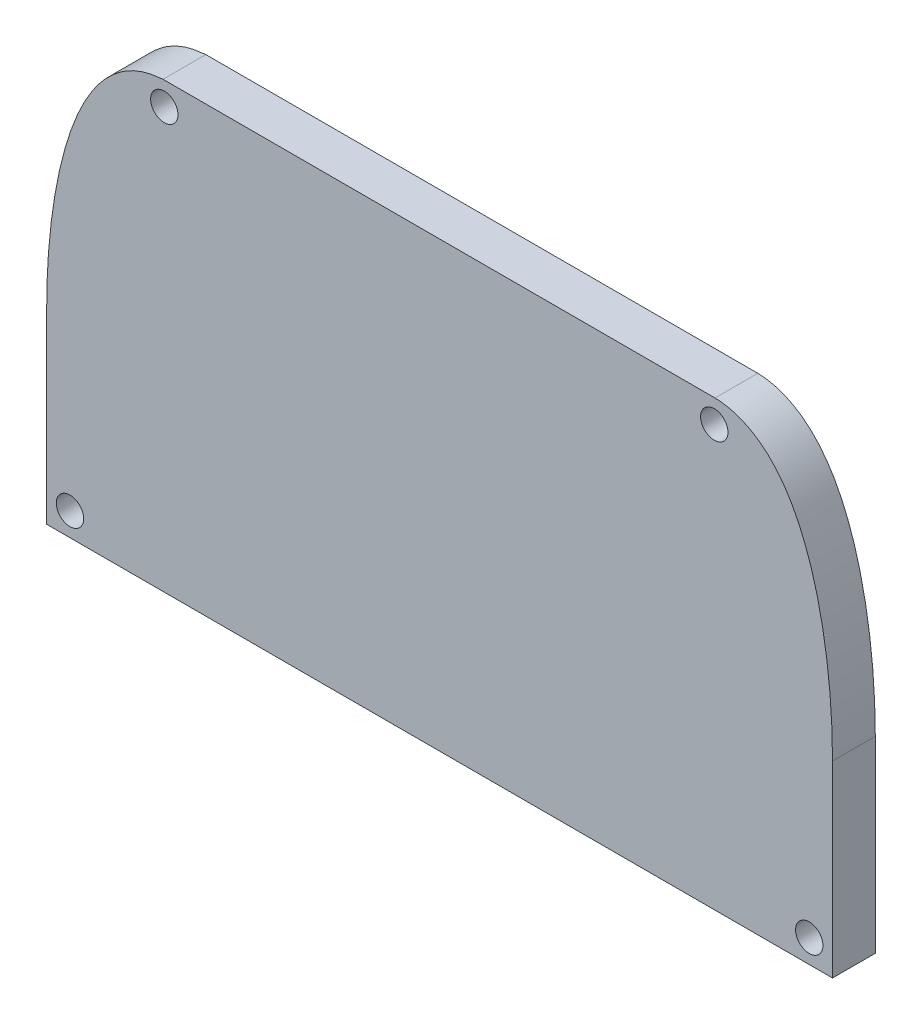
ISO-10303-21;
HEADER;
FILE_DESCRIPTION(('STEP AP214'),'2;1');
FILE_NAME('part.step','',(''),(''),'','','');
FILE_SCHEMA(('AUTOMOTIVE_DESIGN { 1 0 10303 214 1 1 1 1 }'));
ENDSEC;
DATA;
#1=APPLICATION_CONTEXT('core data for automotive mechanical design processes');
#2=APPLICATION_PROTOCOL_DEFINITION('international standard','automotive_design',2000,#1);
#3=PRODUCT_CONTEXT('',#1,'mechanical');
#4=PRODUCT('Part','Part','',(#3));
#5=PRODUCT_RELATED_PRODUCT_CATEGORY('part','',(#4));
#6=PRODUCT_DEFINITION_FORMATION('','',#4);
#7=PRODUCT_DEFINITION_CONTEXT('part definition',#1,'design');
#8=PRODUCT_DEFINITION('design','',#6,#7);
#9=PRODUCT_DEFINITION_SHAPE('','',#8);
#10=(LENGTH_UNIT() NAMED_UNIT(*) SI_UNIT(.MILLI.,.METRE.));
#11=(NAMED_UNIT(*) PLANE_ANGLE_UNIT() SI_UNIT($,.RADIAN.));
#12=(NAMED_UNIT(*) SI_UNIT($,.STERADIAN.) SOLID_ANGLE_UNIT());
#13=UNCERTAINTY_MEASURE_WITH_UNIT(LENGTH_MEASURE(1.E-05),#10,'distance_accuracy_value','');
#14=(GEOMETRIC_REPRESENTATION_CONTEXT(3) GLOBAL_UNCERTAINTY_ASSIGNED_CONTEXT((#13)) GLOBAL_UNIT_ASSIGNED_CONTEXT((#10,
#11,#12)) REPRESENTATION_CONTEXT('',''));
#15=CARTESIAN_POINT('',(0.,0.,0.));
#16=DIRECTION('',(0.,0.,1.));
#17=DIRECTION('',(1.,0.,0.));
#18=AXIS2_PLACEMENT_3D('',#15,#16,#17);
#19=CARTESIAN_POINT('',(-20.2031299012888,38.8775103117282,3.125));
#20=CARTESIAN_POINT('',(-20.6299370312421,38.8425432630061,3.125));
#21=CARTESIAN_POINT('',(-21.2365770901515,38.7293476692277,3.125));
#22=CARTESIAN_POINT('',(-21.7787783124559,38.5939845344441,3.125));
#23=CARTESIAN_POINT('',(-22.8102743204747,38.1543126758593,3.125));
#24=CARTESIAN_POINT('',(-23.7716144326433,37.4400939137029,3.125));
#25=CARTESIAN_POINT('',(-24.3768724896182,36.8494792872663,3.125));
#26=CARTESIAN_POINT('',(-24.8388727645608,36.3127991268402,3.125));
#27=CARTESIAN_POINT('',(-25.2341536045405,35.7760936133862,3.125));
#28=CARTESIAN_POINT('',(-25.6269844321493,35.1612285433474,3.125));
#29=CARTESIAN_POINT('',(-25.9472276573327,34.5877555784463,3.125));
#30=CARTESIAN_POINT('',(-26.2795466081274,33.9133394349288,3.125));
#31=CARTESIAN_POINT('',(-26.5359865020166,33.3294266872606,3.125));
#32=CARTESIAN_POINT('',(-26.7897757638346,32.689408081855,3.125));
#33=CARTESIAN_POINT('',(-27.0269246103089,32.0230810706468,3.125));
#34=CARTESIAN_POINT('',(-27.2573329434744,31.2983450904732,3.125));
#35=CARTESIAN_POINT('',(-27.4335637787405,30.6825001719424,3.125));
#36=CARTESIAN_POINT('',(-27.6069824014113,30.0157827044821,3.125));
#37=CARTESIAN_POINT('',(-27.7680984967872,29.3289301463425,3.125));
#38=CARTESIAN_POINT('',(-27.9221330026003,28.5974838959154,3.125));
#39=CARTESIAN_POINT('',(-28.0465595621333,27.9395798152964,3.125));
#40=CARTESIAN_POINT('',(-28.1922280839524,27.08168551276,3.125));
#41=CARTESIAN_POINT('',(-28.3674536756337,25.8348274061817,3.125));
#42=CARTESIAN_POINT('',(-28.5162514330903,24.4381764406579,3.125));
#43=CARTESIAN_POINT('',(-28.6106169145931,23.1928281129806,3.125));
#44=CARTESIAN_POINT('',(-28.6481655742006,22.4360444979002,3.125));
#45=CARTESIAN_POINT('',(-28.6631956686964,22.0319801847861,3.125));
#46=CARTESIAN_POINT('',(-28.670287972966,21.8062878665656,3.125));
#47=CARTESIAN_POINT('',(-28.6757196537256,21.6075614959583,3.125));
#48=CARTESIAN_POINT('',(-28.6783448183677,21.4974656488177,3.125));
#49=CARTESIAN_POINT('',(-28.6822331339818,21.3196666692372,3.125));
#50=CARTESIAN_POINT('',(-28.692153993551,20.7941564589934,3.125));
#51=CARTESIAN_POINT('',(-28.7000000000001,20.2019635455945,3.125));
#52=B_SPLINE_CURVE_WITH_KNOTS('',2,(#19,#20,#21,#22,#23,#24,#25,#26,#27,#28,#29,#30,#31,#32,#33,
#34,#35,#36,#37,#38,#39,#40,#41,#42,#43,#44,#45,#46,#47,#48,#49,#50,#51),.UNSPECIFIED.,.F.,.F.,
(3,1,1,1,1,1,1,1,1,1,1,1,1,1,1,1,1,1,1,1,1,1,1,1,1,1,1,1,1,1,1,3),(6.54310850195519E-05,
0.0391094534319687,0.0547270623707485,0.0937710847176978,0.156241520472817,0.203094347289156,
0.234329565166715,0.265564783044275,0.296800000921834,0.328035218799394,0.359270436676953,
0.390505654554513,0.421740872432072,0.452976090309631,0.484211308187191,0.51544652606475,
0.54668174394231,0.577916961819869,0.609152179697429,0.640387397574988,0.671622615452547,
0.718475442268887,0.780945878024006,0.843416313779124,0.890269140595464,0.913695554003633,
0.925408760707718,0.933217565177108,0.941026369646498,0.948835174115887,0.960548380819972,
0.999592403166922),.UNSPECIFIED.);
#53=DIRECTION('',(0.,0.,-1.));
#54=VECTOR('',#53,1.);
#55=SURFACE_OF_LINEAR_EXTRUSION('',#52,#54);
#56=CARTESIAN_POINT('',(-20.2031299012888,38.8775103117282,0.));
#57=CARTESIAN_POINT('',(-20.6299370312421,38.8425432630061,0.));
#58=CARTESIAN_POINT('',(-21.2365770901515,38.7293476692277,0.));
#59=CARTESIAN_POINT('',(-21.7787783124559,38.5939845344441,0.));
#60=CARTESIAN_POINT('',(-22.8102743204747,38.1543126758593,0.));
#61=CARTESIAN_POINT('',(-23.7716144326433,37.4400939137029,0.));
#62=CARTESIAN_POINT('',(-24.3768724896182,36.8494792872663,0.));
#63=CARTESIAN_POINT('',(-24.8388727645608,36.3127991268402,0.));
#64=CARTESIAN_POINT('',(-25.2341536045405,35.7760936133862,0.));
#65=CARTESIAN_POINT('',(-25.6269844321493,35.1612285433474,0.));
#66=CARTESIAN_POINT('',(-25.9472276573327,34.5877555784463,0.));
#67=CARTESIAN_POINT('',(-26.2795466081274,33.9133394349288,0.));
#68=CARTESIAN_POINT('',(-26.5359865020166,33.3294266872606,0.));
#69=CARTESIAN_POINT('',(-26.7897757638346,32.689408081855,0.));
#70=CARTESIAN_POINT('',(-27.0269246103089,32.0230810706468,0.));
#71=CARTESIAN_POINT('',(-27.2573329434744,31.2983450904732,0.));
#72=CARTESIAN_POINT('',(-27.4335637787405,30.6825001719424,0.));
#73=CARTESIAN_POINT('',(-27.6069824014113,30.0157827044821,0.));
#74=CARTESIAN_POINT('',(-27.7680984967872,29.3289301463425,0.));
#75=CARTESIAN_POINT('',(-27.9221330026003,28.5974838959154,0.));
#76=CARTESIAN_POINT('',(-28.0465595621333,27.9395798152964,0.));
#77=CARTESIAN_POINT('',(-28.1922280839524,27.08168551276,0.));
#78=CARTESIAN_POINT('',(-28.3674536756337,25.8348274061817,0.));
#79=CARTESIAN_POINT('',(-28.5162514330903,24.4381764406579,0.));
#80=CARTESIAN_POINT('',(-28.6106169145931,23.1928281129806,0.));
#81=CARTESIAN_POINT('',(-28.6481655742006,22.4360444979002,0.));
#82=CARTESIAN_POINT('',(-28.6631956686964,22.0319801847861,0.));
#83=CARTESIAN_POINT('',(-28.670287972966,21.8062878665656,0.));
#84=CARTESIAN_POINT('',(-28.6757196537256,21.6075614959583,0.));
#85=CARTESIAN_POINT('',(-28.6783448183677,21.4974656488177,0.));
#86=CARTESIAN_POINT('',(-28.6822331339818,21.3196666692372,0.));
#87=CARTESIAN_POINT('',(-28.692153993551,20.7941564589934,0.));
#88=CARTESIAN_POINT('',(-28.7000000000001,20.2019635455945,0.));
#89=B_SPLINE_CURVE_WITH_KNOTS('',2,(#56,#57,#58,#59,#60,#61,#62,#63,#64,#65,#66,#67,#68,#69,#70,
#71,#72,#73,#74,#75,#76,#77,#78,#79,#80,#81,#82,#83,#84,#85,#86,#87,#88),.UNSPECIFIED.,.F.,.F.,
(3,1,1,1,1,1,1,1,1,1,1,1,1,1,1,1,1,1,1,1,1,1,1,1,1,1,1,1,1,1,1,3),(6.54310850195519E-05,
0.0391094534319687,0.0547270623707485,0.0937710847176978,0.156241520472817,0.203094347289156,
0.234329565166715,0.265564783044275,0.296800000921834,0.328035218799394,0.359270436676953,
0.390505654554513,0.421740872432072,0.452976090309631,0.484211308187191,0.51544652606475,
0.54668174394231,0.577916961819869,0.609152179697429,0.640387397574988,0.671622615452547,
0.718475442268887,0.780945878024006,0.843416313779124,0.890269140595464,0.913695554003633,
0.925408760707718,0.933217565177108,0.941026369646498,0.948835174115887,0.960548380819972,
0.999592403166922),.UNSPECIFIED.);
#90=CARTESIAN_POINT('',(-20.2031299012888,38.8775103117282,0.));
#91=VERTEX_POINT('',#90);
#92=CARTESIAN_POINT('',(-28.7000000000001,20.2019635455945,0.));
#93=VERTEX_POINT('',#92);
#94=EDGE_CURVE('E149',#91,#93,#89,.T.);
#95=ORIENTED_EDGE('',*,*,#94,.T.);
#96=DIRECTION('',(0.,0.,-1.));
#97=VECTOR('',#96,1.);
#98=CARTESIAN_POINT('',(-28.7000000000001,20.2019635455945,3.125));
#99=LINE('',#98,#97);
#100=CARTESIAN_POINT('',(-28.7000000000001,20.2019635455945,3.125));
#101=VERTEX_POINT('',#100);
#102=EDGE_CURVE('E11',#101,#93,#99,.T.);
#103=ORIENTED_EDGE('',*,*,#102,.F.);
#104=CARTESIAN_POINT('',(-20.2031299012888,38.8775103117282,3.125));
#105=VERTEX_POINT('',#104);
#106=EDGE_CURVE('E162',#105,#101,#52,.T.);
#107=ORIENTED_EDGE('',*,*,#106,.F.);
#108=DIRECTION('',(0.,0.,-1.));
#109=VECTOR('',#108,1.);
#110=CARTESIAN_POINT('',(-20.2031299012888,38.8775103117282,3.125));
#111=LINE('',#110,#109);
#112=EDGE_CURVE('E114',#105,#91,#111,.T.);
#113=ORIENTED_EDGE('',*,*,#112,.T.);
#114=EDGE_LOOP('',(#95,#103,#107,#113));
#115=FACE_BOUND('',#114,.T.);
#116=ADVANCED_FACE('F33',(#115),#55,.F.);
#117=CARTESIAN_POINT('',(-28.7000000000001,6.47751031172819,3.125));
#118=DIRECTION('',(1.,0.,0.));
#119=DIRECTION('',(0.,1.,0.));
#120=AXIS2_PLACEMENT_3D('',#117,#118,#119);
#121=PLANE('',#120);
#122=DIRECTION('',(0.,-1.,0.));
#123=VECTOR('',#122,1.);
#124=CARTESIAN_POINT('',(-28.7000000000001,6.47751031172819,0.));
#125=LINE('',#124,#123);
#126=CARTESIAN_POINT('',(-28.7000000000001,6.47751031172819,0.));
#127=VERTEX_POINT('',#126);
#128=EDGE_CURVE('E141',#93,#127,#125,.T.);
#129=ORIENTED_EDGE('',*,*,#128,.T.);
#130=DIRECTION('',(0.,0.,-1.));
#131=VECTOR('',#130,1.);
#132=CARTESIAN_POINT('',(-28.7000000000001,6.47751031172819,3.125));
#133=LINE('',#132,#131);
#134=CARTESIAN_POINT('',(-28.7000000000001,6.47751031172819,3.125));
#135=VERTEX_POINT('',#134);
#136=EDGE_CURVE('E42',#135,#127,#133,.T.);
#137=ORIENTED_EDGE('',*,*,#136,.F.);
#138=DIRECTION('',(0.,-1.,0.));
#139=VECTOR('',#138,1.);
#140=CARTESIAN_POINT('',(-28.7000000000001,6.47751031172819,3.125));
#141=LINE('',#140,#139);
#142=EDGE_CURVE('E87',#101,#135,#141,.T.);
#143=ORIENTED_EDGE('',*,*,#142,.F.);
#144=ORIENTED_EDGE('',*,*,#102,.T.);
#145=EDGE_LOOP('',(#129,#137,#143,#144));
#146=FACE_BOUND('',#145,.T.);
#147=ADVANCED_FACE('F134',(#146),#121,.F.);
#148=CARTESIAN_POINT('',(-28.7000000000001,6.47751031172819,3.125));
#149=DIRECTION('',(0.,1.,0.));
#150=DIRECTION('',(-1.,0.,0.));
#151=AXIS2_PLACEMENT_3D('',#148,#149,#150);
#152=PLANE('',#151);
#153=DIRECTION('',(1.,0.,0.));
#154=VECTOR('',#153,1.);
#155=CARTESIAN_POINT('',(-28.7000000000001,6.47751031172819,0.));
#156=LINE('',#155,#154);
#157=CARTESIAN_POINT('',(28.7,6.47751031172819,0.));
#158=VERTEX_POINT('',#157);
#159=EDGE_CURVE('E148',#127,#158,#156,.T.);
#160=ORIENTED_EDGE('',*,*,#159,.T.);
#161=DIRECTION('',(0.,0.,-1.));
#162=VECTOR('',#161,1.);
#163=CARTESIAN_POINT('',(28.7,6.47751031172819,3.125));
#164=LINE('',#163,#162);
#165=CARTESIAN_POINT('',(28.7,6.47751031172819,3.125));
#166=VERTEX_POINT('',#165);
#167=EDGE_CURVE('E109',#166,#158,#164,.T.);
#168=ORIENTED_EDGE('',*,*,#167,.F.);
#169=DIRECTION('',(1.,0.,0.));
#170=VECTOR('',#169,1.);
#171=CARTESIAN_POINT('',(-28.7000000000001,6.47751031172819,3.125));
#172=LINE('',#171,#170);
#173=EDGE_CURVE('E100',#135,#166,#172,.T.);
#174=ORIENTED_EDGE('',*,*,#173,.F.);
#175=ORIENTED_EDGE('',*,*,#136,.T.);
#176=EDGE_LOOP('',(#160,#168,#174,#175));
#177=FACE_BOUND('',#176,.T.);
#178=ADVANCED_FACE('F132',(#177),#152,.F.);
#179=CARTESIAN_POINT('',(28.7,20.2019195429257,3.125));
#180=DIRECTION('',(-1.,0.,0.));
#181=DIRECTION('',(0.,0.,1.));
#182=AXIS2_PLACEMENT_3D('',#179,#180,#181);
#183=PLANE('',#182);
#184=DIRECTION('',(0.,1.,0.));
#185=VECTOR('',#184,1.);
#186=CARTESIAN_POINT('',(28.7,20.2019195429257,0.));
#187=LINE('',#186,#185);
#188=CARTESIAN_POINT('',(28.7,20.2019195429257,0.));
#189=VERTEX_POINT('',#188);
#190=EDGE_CURVE('E108',#158,#189,#187,.T.);
#191=ORIENTED_EDGE('',*,*,#190,.T.);
#192=DIRECTION('',(0.,0.,-1.));
#193=VECTOR('',#192,1.);
#194=CARTESIAN_POINT('',(28.7,20.2019195429257,3.125));
#195=LINE('',#194,#193);
#196=CARTESIAN_POINT('',(28.7,20.2019195429257,3.125));
#197=VERTEX_POINT('',#196);
#198=EDGE_CURVE('E105',#197,#189,#195,.T.);
#199=ORIENTED_EDGE('',*,*,#198,.F.);
#200=DIRECTION('',(0.,1.,0.));
#201=VECTOR('',#200,1.);
#202=CARTESIAN_POINT('',(28.7,20.2019195429257,3.125));
#203=LINE('',#202,#201);
#204=EDGE_CURVE('E94',#166,#197,#203,.T.);
#205=ORIENTED_EDGE('',*,*,#204,.F.);
#206=ORIENTED_EDGE('',*,*,#167,.T.);
#207=EDGE_LOOP('',(#191,#199,#205,#206));
#208=FACE_BOUND('',#207,.T.);
#209=ADVANCED_FACE('F106',(#208),#183,.F.);
#210=CARTESIAN_POINT('',(28.7,20.2019195429257,3.125));
#211=CARTESIAN_POINT('',(28.6921381530834,20.7963741437731,3.125));
#212=CARTESIAN_POINT('',(28.6821598194482,21.3240922358117,3.125));
#213=CARTESIAN_POINT('',(28.6782456221438,21.5026214553894,3.125));
#214=CARTESIAN_POINT('',(28.6755957088048,21.6133993037347,3.125));
#215=CARTESIAN_POINT('',(28.6701349734946,21.8124013744383,3.125));
#216=CARTESIAN_POINT('',(28.6629908925135,22.0386747505654,3.125));
#217=CARTESIAN_POINT('',(28.6478320759963,22.4440637972229,3.125));
#218=CARTESIAN_POINT('',(28.609846110995,23.2054255021901,3.125));
#219=CARTESIAN_POINT('',(28.5147051726897,24.4550744958958,3.125));
#220=CARTESIAN_POINT('',(28.3647827399554,25.8575105449066,3.125));
#221=CARTESIAN_POINT('',(28.1870390569971,27.1154808666542,3.125));
#222=CARTESIAN_POINT('',(28.0391005301037,27.9809536248525,3.125));
#223=CARTESIAN_POINT('',(27.9127751590614,28.6443548520366,3.125));
#224=CARTESIAN_POINT('',(27.7554313614732,29.3857482116129,3.125));
#225=CARTESIAN_POINT('',(27.5908114669729,30.0809874372207,3.125));
#226=CARTESIAN_POINT('',(27.4135612697981,30.7553237957285,3.125));
#227=CARTESIAN_POINT('',(27.2326293159793,31.379979175442,3.125));
#228=CARTESIAN_POINT('',(27.0000508631283,32.1021666936677,3.125));
#229=CARTESIAN_POINT('',(26.7599716146766,32.767993982975,3.125));
#230=CARTESIAN_POINT('',(26.502830910381,33.4079632981018,3.125));
#231=CARTESIAN_POINT('',(26.2757832104136,33.9174561338709,3.125));
#232=CARTESIAN_POINT('',(26.0759642514773,34.329555216563,3.125));
#233=CARTESIAN_POINT('',(25.8806930883179,34.7085385398756,3.125));
#234=CARTESIAN_POINT('',(25.5802427794289,35.2389471106148,3.125));
#235=CARTESIAN_POINT('',(25.1937724414961,35.834092452734,3.125));
#236=CARTESIAN_POINT('',(24.7922219648226,36.3709228041016,3.125));
#237=CARTESIAN_POINT('',(24.3173532175694,36.9129318576325,3.125));
#238=CARTESIAN_POINT('',(23.7199478169352,37.486220746945,3.125));
#239=CARTESIAN_POINT('',(22.7358860334727,38.1911253753131,3.125));
#240=CARTESIAN_POINT('',(21.1567491820058,38.8507674625829,3.125));
#241=CARTESIAN_POINT('',(20.1171550867671,38.8775103117282,3.125));
#242=B_SPLINE_CURVE_WITH_KNOTS('',2,(#210,#211,#212,#213,#214,#215,#216,#217,#218,#219,#220,
#221,#222,#223,#224,#225,#226,#227,#228,#229,#230,#231,#232,#233,#234,#235,#236,#237,#238,#239,
#240,#241),.UNSPECIFIED.,.F.,.F.,(3,1,1,1,1,1,1,1,1,1,1,1,1,1,1,1,1,1,1,1,1,1,1,1,1,1,1,1,1,1,
3),(0.000288080277904365,0.0393367852848776,0.0510513967869695,0.0588611377883643,
0.0666708787897589,0.0744806197911537,0.0861952312932457,0.10962445429743,0.156482900305797,
0.218960828316955,0.281438756328112,0.32829720233648,0.359536166342058,0.390775130347637,
0.422014094353216,0.453253058358794,0.484492022364373,0.515730986369952,0.54696995037553,
0.578208914381109,0.609447878386687,0.632877101390871,0.648496583393661,0.671925806397845,
0.703164770403423,0.734403734409002,0.76564269841458,0.796881662420159,0.843740108428527,
0.906218036439684,0.99993492845642),.UNSPECIFIED.);
#243=DIRECTION('',(0.,0.,-1.));
#244=VECTOR('',#243,1.);
#245=SURFACE_OF_LINEAR_EXTRUSION('',#242,#244);
#246=CARTESIAN_POINT('',(28.7,20.2019195429257,0.));
#247=CARTESIAN_POINT('',(28.6921381530834,20.7963741437731,0.));
#248=CARTESIAN_POINT('',(28.6821598194482,21.3240922358117,0.));
#249=CARTESIAN_POINT('',(28.6782456221438,21.5026214553894,0.));
#250=CARTESIAN_POINT('',(28.6755957088048,21.6133993037347,0.));
#251=CARTESIAN_POINT('',(28.6701349734946,21.8124013744383,0.));
#252=CARTESIAN_POINT('',(28.6629908925135,22.0386747505654,0.));
#253=CARTESIAN_POINT('',(28.6478320759963,22.4440637972229,0.));
#254=CARTESIAN_POINT('',(28.609846110995,23.2054255021901,0.));
#255=CARTESIAN_POINT('',(28.5147051726897,24.4550744958958,0.));
#256=CARTESIAN_POINT('',(28.3647827399554,25.8575105449066,0.));
#257=CARTESIAN_POINT('',(28.1870390569971,27.1154808666542,0.));
#258=CARTESIAN_POINT('',(28.0391005301037,27.9809536248525,0.));
#259=CARTESIAN_POINT('',(27.9127751590614,28.6443548520366,0.));
#260=CARTESIAN_POINT('',(27.7554313614732,29.3857482116129,0.));
#261=CARTESIAN_POINT('',(27.5908114669729,30.0809874372207,0.));
#262=CARTESIAN_POINT('',(27.4135612697981,30.7553237957285,0.));
#263=CARTESIAN_POINT('',(27.2326293159793,31.379979175442,0.));
#264=CARTESIAN_POINT('',(27.0000508631283,32.1021666936677,0.));
#265=CARTESIAN_POINT('',(26.7599716146766,32.767993982975,0.));
#266=CARTESIAN_POINT('',(26.502830910381,33.4079632981018,0.));
#267=CARTESIAN_POINT('',(26.2757832104136,33.9174561338709,0.));
#268=CARTESIAN_POINT('',(26.0759642514773,34.329555216563,0.));
#269=CARTESIAN_POINT('',(25.8806930883179,34.7085385398756,0.));
#270=CARTESIAN_POINT('',(25.5802427794289,35.2389471106148,0.));
#271=CARTESIAN_POINT('',(25.1937724414961,35.834092452734,0.));
#272=CARTESIAN_POINT('',(24.7922219648226,36.3709228041016,0.));
#273=CARTESIAN_POINT('',(24.3173532175694,36.9129318576325,0.));
#274=CARTESIAN_POINT('',(23.7199478169352,37.486220746945,0.));
#275=CARTESIAN_POINT('',(22.7358860334727,38.1911253753131,0.));
#276=CARTESIAN_POINT('',(21.1567491820058,38.8507674625829,0.));
#277=CARTESIAN_POINT('',(20.1171550867671,38.8775103117282,0.));
#278=B_SPLINE_CURVE_WITH_KNOTS('',2,(#246,#247,#248,#249,#250,#251,#252,#253,#254,#255,#256,
#257,#258,#259,#260,#261,#262,#263,#264,#265,#266,#267,#268,#269,#270,#271,#272,#273,#274,#275,
#276,#277),.UNSPECIFIED.,.F.,.F.,(3,1,1,1,1,1,1,1,1,1,1,1,1,1,1,1,1,1,1,1,1,1,1,1,1,1,1,1,1,1,
3),(0.000288080277904365,0.0393367852848776,0.0510513967869695,0.0588611377883643,
0.0666708787897589,0.0744806197911537,0.0861952312932457,0.10962445429743,0.156482900305797,
0.218960828316955,0.281438756328112,0.32829720233648,0.359536166342058,0.390775130347637,
0.422014094353216,0.453253058358794,0.484492022364373,0.515730986369952,0.54696995037553,
0.578208914381109,0.609447878386687,0.632877101390871,0.648496583393661,0.671925806397845,
0.703164770403423,0.734403734409002,0.76564269841458,0.796881662420159,0.843740108428527,
0.906218036439684,0.99993492845642),.UNSPECIFIED.);
#279=CARTESIAN_POINT('',(20.1171550867671,38.8775103117282,0.));
#280=VERTEX_POINT('',#279);
#281=EDGE_CURVE('E73',#189,#280,#278,.T.);
#282=ORIENTED_EDGE('',*,*,#281,.T.);
#283=DIRECTION('',(0.,0.,-1.));
#284=VECTOR('',#283,1.);
#285=CARTESIAN_POINT('',(20.1171550867671,38.8775103117282,3.125));
#286=LINE('',#285,#284);
#287=CARTESIAN_POINT('',(20.1171550867671,38.8775103117282,3.125));
#288=VERTEX_POINT('',#287);
#289=EDGE_CURVE('E110',#288,#280,#286,.T.);
#290=ORIENTED_EDGE('',*,*,#289,.F.);
#291=EDGE_CURVE('E98',#197,#288,#242,.T.);
#292=ORIENTED_EDGE('',*,*,#291,.F.);
#293=ORIENTED_EDGE('',*,*,#198,.T.);
#294=EDGE_LOOP('',(#282,#290,#292,#293));
#295=FACE_BOUND('',#294,.T.);
#296=ADVANCED_FACE('F112',(#295),#245,.F.);
#297=CARTESIAN_POINT('',(-20.2031299012888,38.8775103117282,3.125));
#298=DIRECTION('',(0.,-1.,0.));
#299=DIRECTION('',(1.,0.,0.));
#300=AXIS2_PLACEMENT_3D('',#297,#298,#299);
#301=PLANE('',#300);
#302=DIRECTION('',(-1.,0.,0.));
#303=VECTOR('',#302,1.);
#304=CARTESIAN_POINT('',(-20.2031299012888,38.8775103117282,0.));
#305=LINE('',#304,#303);
#306=EDGE_CURVE('E79',#280,#91,#305,.T.);
#307=ORIENTED_EDGE('',*,*,#306,.T.);
#308=ORIENTED_EDGE('',*,*,#112,.F.);
#309=DIRECTION('',(-1.,0.,0.));
#310=VECTOR('',#309,1.);
#311=CARTESIAN_POINT('',(-20.2031299012888,38.8775103117282,3.125));
#312=LINE('',#311,#310);
#313=EDGE_CURVE('E50',#288,#105,#312,.T.);
#314=ORIENTED_EDGE('',*,*,#313,.F.);
#315=ORIENTED_EDGE('',*,*,#289,.T.);
#316=EDGE_LOOP('',(#307,#308,#314,#315));
#317=FACE_BOUND('',#316,.T.);
#318=ADVANCED_FACE('F128',(#317),#301,.F.);
#319=CARTESIAN_POINT('',(-27.250560756237,31.3119564731786,3.125));
#320=DIRECTION('',(0.,0.,1.));
#321=DIRECTION('',(1.,0.,0.));
#322=AXIS2_PLACEMENT_3D('',#319,#320,#321);
#323=PLANE('',#322);
#324=CARTESIAN_POINT('',(-27.0000000000001,8.17751031172819,3.125));
#325=DIRECTION('',(0.,0.,1.));
#326=DIRECTION('',(1.,0.,0.));
#327=AXIS2_PLACEMENT_3D('',#324,#325,#326);
#328=CIRCLE('',#327,1.00000000000001);
#329=CARTESIAN_POINT('',(-26.0000000000001,8.17751031172819,3.125));
#330=VERTEX_POINT('',#329);
#331=EDGE_CURVE('E167',#330,#330,#328,.T.);
#332=ORIENTED_EDGE('',*,*,#331,.F.);
#333=EDGE_LOOP('',(#332));
#334=FACE_BOUND('',#333,.T.);
#335=CARTESIAN_POINT('',(-20.1097405505847,37.1775103117282,3.125));
#336=DIRECTION('',(0.,0.,1.));
#337=DIRECTION('',(1.,0.,0.));
#338=AXIS2_PLACEMENT_3D('',#335,#336,#337);
#339=CIRCLE('',#338,0.999999999999986);
#340=CARTESIAN_POINT('',(-19.1097405505847,37.1775103117282,3.125));
#341=VERTEX_POINT('',#340);
#342=EDGE_CURVE('E182',#341,#341,#339,.T.);
#343=ORIENTED_EDGE('',*,*,#342,.F.);
#344=EDGE_LOOP('',(#343));
#345=FACE_BOUND('',#344,.T.);
#346=CARTESIAN_POINT('',(20.0628407257937,37.1775103117287,3.125));
#347=DIRECTION('',(0.,0.,1.));
#348=DIRECTION('',(1.,0.,0.));
#349=AXIS2_PLACEMENT_3D('',#346,#347,#348);
#350=CIRCLE('',#349,1.00000000000001);
#351=CARTESIAN_POINT('',(21.0628407257937,37.1775103117287,3.125));
#352=VERTEX_POINT('',#351);
#353=EDGE_CURVE('E188',#352,#352,#350,.T.);
#354=ORIENTED_EDGE('',*,*,#353,.F.);
#355=EDGE_LOOP('',(#354));
#356=FACE_BOUND('',#355,.T.);
#357=CARTESIAN_POINT('',(27.,8.1775103117282,3.125));
#358=DIRECTION('',(0.,0.,1.));
#359=DIRECTION('',(1.,0.,0.));
#360=AXIS2_PLACEMENT_3D('',#357,#358,#359);
#361=CIRCLE('',#360,0.999999999999994);
#362=CARTESIAN_POINT('',(28.,8.1775103117282,3.125));
#363=VERTEX_POINT('',#362);
#364=EDGE_CURVE('E194',#363,#363,#361,.T.);
#365=ORIENTED_EDGE('',*,*,#364,.F.);
#366=EDGE_LOOP('',(#365));
#367=FACE_BOUND('',#366,.T.);
#368=ORIENTED_EDGE('',*,*,#106,.T.);
#369=ORIENTED_EDGE('',*,*,#142,.T.);
#370=ORIENTED_EDGE('',*,*,#173,.T.);
#371=ORIENTED_EDGE('',*,*,#204,.T.);
#372=ORIENTED_EDGE('',*,*,#291,.T.);
#373=ORIENTED_EDGE('',*,*,#313,.T.);
#374=EDGE_LOOP('',(#368,#369,#370,#371,#372,#373));
#375=FACE_BOUND('',#374,.T.);
#376=ADVANCED_FACE('F96',(#334,#345,#356,#367,#375),#323,.T.);
#377=CARTESIAN_POINT('',(-27.250560756237,31.3119564731786,0.));
#378=DIRECTION('',(0.,0.,1.));
#379=DIRECTION('',(1.,0.,0.));
#380=AXIS2_PLACEMENT_3D('',#377,#378,#379);
#381=PLANE('',#380);
#382=CARTESIAN_POINT('',(-27.0000000000001,8.17751031172819,0.));
#383=DIRECTION('',(0.,0.,1.));
#384=DIRECTION('',(1.,0.,0.));
#385=AXIS2_PLACEMENT_3D('',#382,#383,#384);
#386=CIRCLE('',#385,1.00000000000001);
#387=CARTESIAN_POINT('',(-26.0000000000001,8.17751031172819,0.));
#388=VERTEX_POINT('',#387);
#389=EDGE_CURVE('E165',#388,#388,#386,.T.);
#390=ORIENTED_EDGE('',*,*,#389,.T.);
#391=EDGE_LOOP('',(#390));
#392=FACE_BOUND('',#391,.T.);
#393=CARTESIAN_POINT('',(-20.1097405505847,37.1775103117282,0.));
#394=DIRECTION('',(0.,0.,1.));
#395=DIRECTION('',(1.,0.,0.));
#396=AXIS2_PLACEMENT_3D('',#393,#394,#395);
#397=CIRCLE('',#396,0.999999999999986);
#398=CARTESIAN_POINT('',(-19.1097405505847,37.1775103117282,0.));
#399=VERTEX_POINT('',#398);
#400=EDGE_CURVE('E177',#399,#399,#397,.T.);
#401=ORIENTED_EDGE('',*,*,#400,.T.);
#402=EDGE_LOOP('',(#401));
#403=FACE_BOUND('',#402,.T.);
#404=CARTESIAN_POINT('',(20.0628407257937,37.1775103117287,0.));
#405=DIRECTION('',(0.,0.,1.));
#406=DIRECTION('',(1.,0.,0.));
#407=AXIS2_PLACEMENT_3D('',#404,#405,#406);
#408=CIRCLE('',#407,1.00000000000001);
#409=CARTESIAN_POINT('',(21.0628407257937,37.1775103117287,0.));
#410=VERTEX_POINT('',#409);
#411=EDGE_CURVE('E185',#410,#410,#408,.T.);
#412=ORIENTED_EDGE('',*,*,#411,.T.);
#413=EDGE_LOOP('',(#412));
#414=FACE_BOUND('',#413,.T.);
#415=CARTESIAN_POINT('',(27.,8.1775103117282,0.));
#416=DIRECTION('',(0.,0.,1.));
#417=DIRECTION('',(1.,0.,0.));
#418=AXIS2_PLACEMENT_3D('',#415,#416,#417);
#419=CIRCLE('',#418,0.999999999999994);
#420=CARTESIAN_POINT('',(28.,8.1775103117282,0.));
#421=VERTEX_POINT('',#420);
#422=EDGE_CURVE('E191',#421,#421,#419,.T.);
#423=ORIENTED_EDGE('',*,*,#422,.T.);
#424=EDGE_LOOP('',(#423));
#425=FACE_BOUND('',#424,.T.);
#426=ORIENTED_EDGE('',*,*,#94,.F.);
#427=ORIENTED_EDGE('',*,*,#306,.F.);
#428=ORIENTED_EDGE('',*,*,#281,.F.);
#429=ORIENTED_EDGE('',*,*,#190,.F.);
#430=ORIENTED_EDGE('',*,*,#159,.F.);
#431=ORIENTED_EDGE('',*,*,#128,.F.);
#432=EDGE_LOOP('',(#426,#427,#428,#429,#430,#431));
#433=FACE_BOUND('',#432,.T.);
#434=ADVANCED_FACE('F151',(#392,#403,#414,#425,#433),#381,.F.);
#435=CARTESIAN_POINT('',(27.,8.1775103117282,0.));
#436=DIRECTION('',(0.,0.,1.));
#437=DIRECTION('',(1.,0.,0.));
#438=AXIS2_PLACEMENT_3D('',#435,#436,#437);
#439=CYLINDRICAL_SURFACE('',#438,0.999999999999994);
#440=ORIENTED_EDGE('',*,*,#422,.F.);
#441=EDGE_LOOP('',(#440));
#442=FACE_BOUND('',#441,.T.);
#443=ORIENTED_EDGE('',*,*,#364,.T.);
#444=EDGE_LOOP('',(#443));
#445=FACE_BOUND('',#444,.T.);
#446=ADVANCED_FACE('F206',(#442,#445),#439,.F.);
#447=CARTESIAN_POINT('',(20.0628407257937,37.1775103117287,0.));
#448=DIRECTION('',(0.,0.,1.));
#449=DIRECTION('',(1.,0.,0.));
#450=AXIS2_PLACEMENT_3D('',#447,#448,#449);
#451=CYLINDRICAL_SURFACE('',#450,1.00000000000001);
#452=ORIENTED_EDGE('',*,*,#411,.F.);
#453=EDGE_LOOP('',(#452));
#454=FACE_BOUND('',#453,.T.);
#455=ORIENTED_EDGE('',*,*,#353,.T.);
#456=EDGE_LOOP('',(#455));
#457=FACE_BOUND('',#456,.T.);
#458=ADVANCED_FACE('F220',(#454,#457),#451,.F.);
#459=CARTESIAN_POINT('',(-20.1097405505847,37.1775103117282,0.));
#460=DIRECTION('',(0.,0.,1.));
#461=DIRECTION('',(1.,0.,0.));
#462=AXIS2_PLACEMENT_3D('',#459,#460,#461);
#463=CYLINDRICAL_SURFACE('',#462,0.999999999999986);
#464=ORIENTED_EDGE('',*,*,#400,.F.);
#465=EDGE_LOOP('',(#464));
#466=FACE_BOUND('',#465,.T.);
#467=ORIENTED_EDGE('',*,*,#342,.T.);
#468=EDGE_LOOP('',(#467));
#469=FACE_BOUND('',#468,.T.);
#470=ADVANCED_FACE('F224',(#466,#469),#463,.F.);
#471=CARTESIAN_POINT('',(-27.0000000000001,8.17751031172819,0.));
#472=DIRECTION('',(0.,0.,1.));
#473=DIRECTION('',(1.,0.,0.));
#474=AXIS2_PLACEMENT_3D('',#471,#472,#473);
#475=CYLINDRICAL_SURFACE('',#474,1.00000000000001);
#476=ORIENTED_EDGE('',*,*,#389,.F.);
#477=EDGE_LOOP('',(#476));
#478=FACE_BOUND('',#477,.T.);
#479=ORIENTED_EDGE('',*,*,#331,.T.);
#480=EDGE_LOOP('',(#479));
#481=FACE_BOUND('',#480,.T.);
#482=ADVANCED_FACE('F228',(#478,#481),#475,.F.);
#483=CLOSED_SHELL('',(#116,#147,#178,#209,#296,#318,#376,#434,#446,#458,#470,#482));
#484=MANIFOLD_SOLID_BREP('B2',#483);
#485=ADVANCED_BREP_SHAPE_REPRESENTATION('',(#18,#484),#14);
#486=SHAPE_DEFINITION_REPRESENTATION(#9,#485);
ENDSEC;
END-ISO-10303-21;
